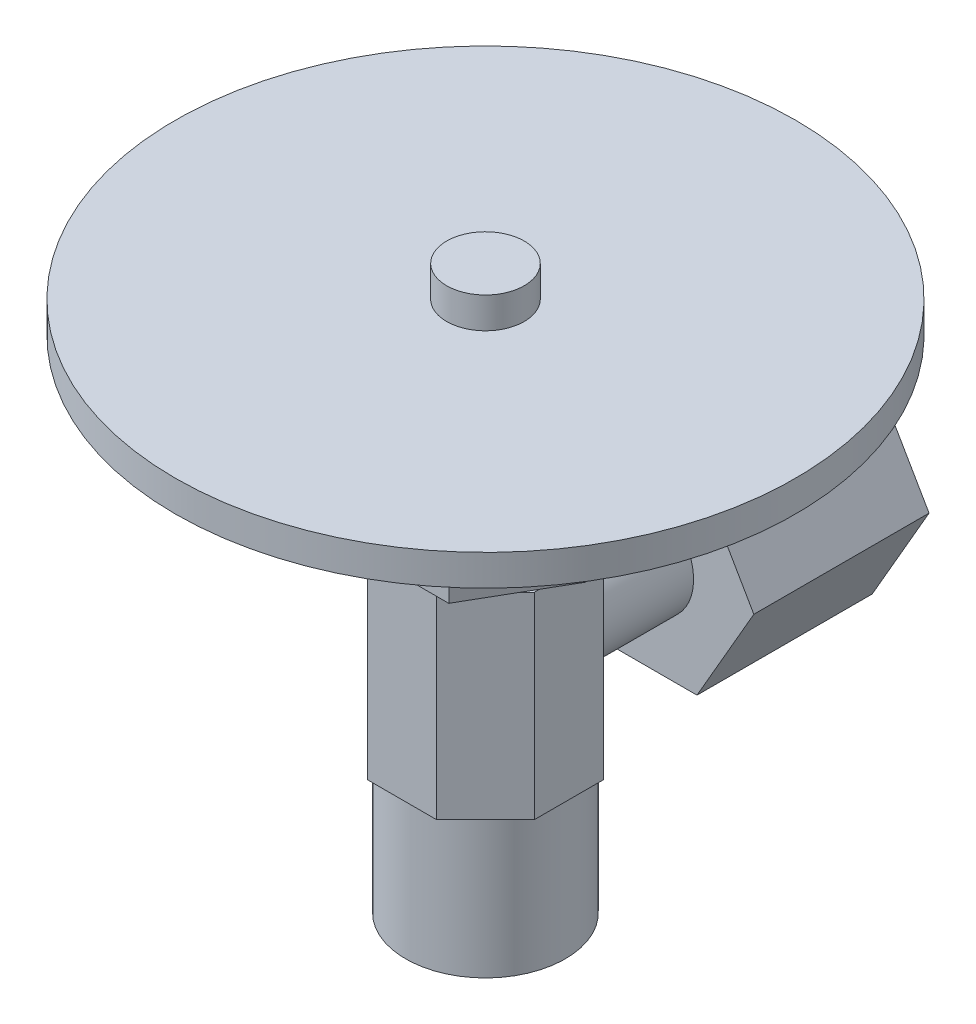
ISO-10303-21;
HEADER;
FILE_DESCRIPTION(('STEP AP214'),'2;1');
FILE_NAME('part.step','',(''),(''),'','','');
FILE_SCHEMA(('AUTOMOTIVE_DESIGN { 1 0 10303 214 1 1 1 1 }'));
ENDSEC;
DATA;
#1=APPLICATION_CONTEXT('core data for automotive mechanical design processes');
#2=APPLICATION_PROTOCOL_DEFINITION('international standard','automotive_design',2000,#1);
#3=PRODUCT_CONTEXT('',#1,'mechanical');
#4=PRODUCT('Part','Part','',(#3));
#5=PRODUCT_RELATED_PRODUCT_CATEGORY('part','',(#4));
#6=PRODUCT_DEFINITION_FORMATION('','',#4);
#7=PRODUCT_DEFINITION_CONTEXT('part definition',#1,'design');
#8=PRODUCT_DEFINITION('design','',#6,#7);
#9=PRODUCT_DEFINITION_SHAPE('','',#8);
#10=(LENGTH_UNIT() NAMED_UNIT(*) SI_UNIT(.MILLI.,.METRE.));
#11=(NAMED_UNIT(*) PLANE_ANGLE_UNIT() SI_UNIT($,.RADIAN.));
#12=(NAMED_UNIT(*) SI_UNIT($,.STERADIAN.) SOLID_ANGLE_UNIT());
#13=UNCERTAINTY_MEASURE_WITH_UNIT(LENGTH_MEASURE(1.E-05),#10,'distance_accuracy_value','');
#14=(GEOMETRIC_REPRESENTATION_CONTEXT(3) GLOBAL_UNCERTAINTY_ASSIGNED_CONTEXT((#13)) GLOBAL_UNIT_ASSIGNED_CONTEXT((#10,
#11,#12)) REPRESENTATION_CONTEXT('',''));
#15=CARTESIAN_POINT('',(0.,0.,0.));
#16=DIRECTION('',(0.,0.,1.));
#17=DIRECTION('',(1.,0.,0.));
#18=AXIS2_PLACEMENT_3D('',#15,#16,#17);
#19=CARTESIAN_POINT('',(0.,27.27,0.));
#20=DIRECTION('',(0.,-1.,0.));
#21=DIRECTION('',(0.,0.,-1.));
#22=AXIS2_PLACEMENT_3D('',#19,#20,#21);
#23=CYLINDRICAL_SURFACE('',#22,2.5);
#24=CARTESIAN_POINT('',(0.,21.27,0.));
#25=DIRECTION('',(0.,1.,0.));
#26=DIRECTION('',(0.,0.,1.));
#27=AXIS2_PLACEMENT_3D('',#24,#25,#26);
#28=CIRCLE('',#27,2.5);
#29=CARTESIAN_POINT('',(0.,21.27,2.5));
#30=VERTEX_POINT('',#29);
#31=EDGE_CURVE('E53',#30,#30,#28,.T.);
#32=ORIENTED_EDGE('',*,*,#31,.T.);
#33=EDGE_LOOP('',(#32));
#34=FACE_BOUND('',#33,.T.);
#35=CARTESIAN_POINT('',(0.,23.27,0.));
#36=DIRECTION('',(0.,1.,0.));
#37=DIRECTION('',(0.,0.,1.));
#38=AXIS2_PLACEMENT_3D('',#35,#36,#37);
#39=CIRCLE('',#38,2.5);
#40=CARTESIAN_POINT('',(0.,23.27,2.5));
#41=VERTEX_POINT('',#40);
#42=EDGE_CURVE('E11',#41,#41,#39,.T.);
#43=ORIENTED_EDGE('',*,*,#42,.F.);
#44=EDGE_LOOP('',(#43));
#45=FACE_BOUND('',#44,.T.);
#46=ADVANCED_FACE('F45',(#34,#45),#23,.T.);
#47=CARTESIAN_POINT('',(0.,12.7,0.));
#48=DIRECTION('',(0.,1.,0.));
#49=DIRECTION('',(0.,0.,1.));
#50=AXIS2_PLACEMENT_3D('',#47,#48,#49);
#51=PLANE('',#50);
#52=DIRECTION('',(0.5,0.,-0.866025403784439));
#53=VECTOR('',#52,1.);
#54=CARTESIAN_POINT('',(3.23316150746191,12.7,5.6));
#55=LINE('',#54,#53);
#56=CARTESIAN_POINT('',(4.91578188977825,12.7,2.68561600797714));
#57=VERTEX_POINT('',#56);
#58=CARTESIAN_POINT('',(5.375,12.7,1.8902269093173));
#59=VERTEX_POINT('',#58);
#60=EDGE_CURVE('E406',#57,#59,#55,.T.);
#61=ORIENTED_EDGE('',*,*,#60,.F.);
#62=DIRECTION('',(0.707106781186547,0.,-0.707106781186548));
#63=VECTOR('',#62,1.);
#64=CARTESIAN_POINT('',(2.22639789775539,12.7,5.375));
#65=LINE('',#64,#63);
#66=CARTESIAN_POINT('',(5.375,12.7,2.22639789775538));
#67=VERTEX_POINT('',#66);
#68=EDGE_CURVE('E319',#57,#67,#65,.T.);
#69=ORIENTED_EDGE('',*,*,#68,.T.);
#70=DIRECTION('',(0.,0.,-1.));
#71=VECTOR('',#70,1.);
#72=CARTESIAN_POINT('',(5.375,12.7,2.22639789775538));
#73=LINE('',#72,#71);
#74=EDGE_CURVE('E320',#67,#59,#73,.T.);
#75=ORIENTED_EDGE('',*,*,#74,.T.);
#76=EDGE_LOOP('',(#61,#69,#75));
#77=FACE_BOUND('',#76,.T.);
#78=ADVANCED_FACE('F491',(#77),#51,.T.);
#79=DIRECTION('',(0.5,0.,0.866025403784439));
#80=VECTOR('',#79,1.);
#81=CARTESIAN_POINT('',(-6.46632301492381,12.7,0.));
#82=LINE('',#81,#80);
#83=CARTESIAN_POINT('',(-5.375,12.7,1.89022690931729));
#84=VERTEX_POINT('',#83);
#85=CARTESIAN_POINT('',(-4.91578188977823,12.7,2.68561600797715));
#86=VERTEX_POINT('',#85);
#87=EDGE_CURVE('E67',#84,#86,#82,.T.);
#88=ORIENTED_EDGE('',*,*,#87,.F.);
#89=DIRECTION('',(0.,0.,1.));
#90=VECTOR('',#89,1.);
#91=CARTESIAN_POINT('',(-5.375,12.7,-2.22639789775539));
#92=LINE('',#91,#90);
#93=CARTESIAN_POINT('',(-5.375,12.7,2.22639789775539));
#94=VERTEX_POINT('',#93);
#95=EDGE_CURVE('E334',#84,#94,#92,.T.);
#96=ORIENTED_EDGE('',*,*,#95,.T.);
#97=DIRECTION('',(0.707106781186548,0.,0.707106781186548));
#98=VECTOR('',#97,1.);
#99=CARTESIAN_POINT('',(-5.375,12.7,2.22639789775539));
#100=LINE('',#99,#98);
#101=EDGE_CURVE('E339',#94,#86,#100,.T.);
#102=ORIENTED_EDGE('',*,*,#101,.T.);
#103=EDGE_LOOP('',(#88,#96,#102));
#104=FACE_BOUND('',#103,.T.);
#105=ADVANCED_FACE('F473',(#104),#51,.T.);
#106=DIRECTION('',(-0.5,0.,0.866025403784438));
#107=VECTOR('',#106,1.);
#108=CARTESIAN_POINT('',(-3.2331615074619,12.7,-5.6));
#109=LINE('',#108,#107);
#110=CARTESIAN_POINT('',(-4.91578188977824,12.7,-2.68561600797715));
#111=VERTEX_POINT('',#110);
#112=CARTESIAN_POINT('',(-5.375,12.7,-1.89022690931729));
#113=VERTEX_POINT('',#112);
#114=EDGE_CURVE('E427',#111,#113,#109,.T.);
#115=ORIENTED_EDGE('',*,*,#114,.F.);
#116=DIRECTION('',(-0.707106781186547,0.,0.707106781186548));
#117=VECTOR('',#116,1.);
#118=CARTESIAN_POINT('',(-2.22639789775539,12.7,-5.375));
#119=LINE('',#118,#117);
#120=CARTESIAN_POINT('',(-5.375,12.7,-2.22639789775539));
#121=VERTEX_POINT('',#120);
#122=EDGE_CURVE('E330',#111,#121,#119,.T.);
#123=ORIENTED_EDGE('',*,*,#122,.T.);
#124=EDGE_CURVE('E335',#121,#113,#92,.T.);
#125=ORIENTED_EDGE('',*,*,#124,.T.);
#126=EDGE_LOOP('',(#115,#123,#125));
#127=FACE_BOUND('',#126,.T.);
#128=ADVANCED_FACE('F460',(#127),#51,.T.);
#129=CARTESIAN_POINT('',(2.22639789775538,12.7,-5.375));
#130=DIRECTION('',(0.,0.,1.));
#131=DIRECTION('',(1.,0.,0.));
#132=AXIS2_PLACEMENT_3D('',#129,#130,#131);
#133=PLANE('',#132);
#134=DIRECTION('',(0.,-1.,0.));
#135=VECTOR('',#134,1.);
#136=CARTESIAN_POINT('',(2.22639789775538,12.7,-5.375));
#137=LINE('',#136,#135);
#138=CARTESIAN_POINT('',(2.22639789775538,12.7,-5.375));
#139=VERTEX_POINT('',#138);
#140=CARTESIAN_POINT('',(2.22639789775538,8.97891874633143,-5.375));
#141=VERTEX_POINT('',#140);
#142=EDGE_CURVE('E379',#139,#141,#137,.T.);
#143=ORIENTED_EDGE('',*,*,#142,.T.);
#144=CARTESIAN_POINT('',(0.,6.35,-5.375));
#145=DIRECTION('',(0.,0.,1.));
#146=DIRECTION('',(1.,0.,0.));
#147=AXIS2_PLACEMENT_3D('',#144,#145,#146);
#148=CIRCLE('',#147,3.44500527923288);
#149=CARTESIAN_POINT('',(-2.22639789775539,8.97891874633144,-5.375));
#150=VERTEX_POINT('',#149);
#151=EDGE_CURVE('E310',#141,#150,#148,.T.);
#152=ORIENTED_EDGE('',*,*,#151,.T.);
#153=DIRECTION('',(0.,-1.,0.));
#154=VECTOR('',#153,1.);
#155=CARTESIAN_POINT('',(-2.22639789775539,12.7,-5.375));
#156=LINE('',#155,#154);
#157=CARTESIAN_POINT('',(-2.22639789775539,12.7,-5.375));
#158=VERTEX_POINT('',#157);
#159=EDGE_CURVE('E375',#158,#150,#156,.T.);
#160=ORIENTED_EDGE('',*,*,#159,.F.);
#161=DIRECTION('',(-1.,0.,0.));
#162=VECTOR('',#161,1.);
#163=CARTESIAN_POINT('',(2.22639789775538,12.7,-5.375));
#164=LINE('',#163,#162);
#165=EDGE_CURVE('E327',#139,#158,#164,.T.);
#166=ORIENTED_EDGE('',*,*,#165,.F.);
#167=EDGE_LOOP('',(#143,#152,#160,#166));
#168=FACE_BOUND('',#167,.T.);
#169=ADVANCED_FACE('F686',(#168),#133,.F.);
#170=CARTESIAN_POINT('',(2.22639789775539,12.7,5.375));
#171=DIRECTION('',(-0.707106781186548,0.,-0.707106781186547));
#172=DIRECTION('',(-0.707106781186547,0.,0.707106781186548));
#173=AXIS2_PLACEMENT_3D('',#170,#171,#172);
#174=PLANE('',#173);
#175=DIRECTION('',(0.707106781186547,0.,-0.707106781186548));
#176=VECTOR('',#175,1.);
#177=CARTESIAN_POINT('',(2.22639789775539,0.,5.375));
#178=LINE('',#177,#176);
#179=CARTESIAN_POINT('',(2.22639789775539,0.,5.375));
#180=VERTEX_POINT('',#179);
#181=CARTESIAN_POINT('',(5.375,0.,2.22639789775538));
#182=VERTEX_POINT('',#181);
#183=EDGE_CURVE('E314',#180,#182,#178,.T.);
#184=ORIENTED_EDGE('',*,*,#183,.T.);
#185=DIRECTION('',(0.,-1.,0.));
#186=VECTOR('',#185,1.);
#187=CARTESIAN_POINT('',(5.375,12.7,2.22639789775538));
#188=LINE('',#187,#186);
#189=EDGE_CURVE('E385',#67,#182,#188,.T.);
#190=ORIENTED_EDGE('',*,*,#189,.F.);
#191=ORIENTED_EDGE('',*,*,#68,.F.);
#192=CARTESIAN_POINT('',(2.22639789775539,12.7,5.375));
#193=VERTEX_POINT('',#192);
#194=EDGE_CURVE('E315',#193,#57,#65,.T.);
#195=ORIENTED_EDGE('',*,*,#194,.F.);
#196=DIRECTION('',(0.,-1.,0.));
#197=VECTOR('',#196,1.);
#198=CARTESIAN_POINT('',(2.22639789775539,12.7,5.375));
#199=LINE('',#198,#197);
#200=EDGE_CURVE('E344',#193,#180,#199,.T.);
#201=ORIENTED_EDGE('',*,*,#200,.T.);
#202=EDGE_LOOP('',(#184,#190,#191,#195,#201));
#203=FACE_BOUND('',#202,.T.);
#204=ADVANCED_FACE('F47',(#203),#174,.F.);
#205=CARTESIAN_POINT('',(5.375,12.7,2.22639789775538));
#206=DIRECTION('',(-1.,0.,0.));
#207=DIRECTION('',(0.,0.,1.));
#208=AXIS2_PLACEMENT_3D('',#205,#206,#207);
#209=PLANE('',#208);
#210=DIRECTION('',(0.,0.,-1.));
#211=VECTOR('',#210,1.);
#212=CARTESIAN_POINT('',(5.375,0.,2.22639789775538));
#213=LINE('',#212,#211);
#214=CARTESIAN_POINT('',(5.375,0.,-2.22639789775539));
#215=VERTEX_POINT('',#214);
#216=EDGE_CURVE('E347',#182,#215,#213,.T.);
#217=ORIENTED_EDGE('',*,*,#216,.T.);
#218=DIRECTION('',(0.,-1.,0.));
#219=VECTOR('',#218,1.);
#220=CARTESIAN_POINT('',(5.375,12.7,-2.22639789775539));
#221=LINE('',#220,#219);
#222=CARTESIAN_POINT('',(5.375,12.7,-2.22639789775539));
#223=VERTEX_POINT('',#222);
#224=EDGE_CURVE('E382',#223,#215,#221,.T.);
#225=ORIENTED_EDGE('',*,*,#224,.F.);
#226=CARTESIAN_POINT('',(5.375,12.7,-1.8902269093173));
#227=VERTEX_POINT('',#226);
#228=EDGE_CURVE('E318',#227,#223,#73,.T.);
#229=ORIENTED_EDGE('',*,*,#228,.F.);
#230=EDGE_CURVE('E324',#59,#227,#73,.T.);
#231=ORIENTED_EDGE('',*,*,#230,.F.);
#232=ORIENTED_EDGE('',*,*,#74,.F.);
#233=ORIENTED_EDGE('',*,*,#189,.T.);
#234=EDGE_LOOP('',(#217,#225,#229,#231,#232,#233));
#235=FACE_BOUND('',#234,.T.);
#236=ADVANCED_FACE('F861',(#235),#209,.F.);
#237=CARTESIAN_POINT('',(5.375,12.7,-2.22639789775539));
#238=DIRECTION('',(-0.707106781186547,0.,0.707106781186548));
#239=DIRECTION('',(0.707106781186548,0.,0.707106781186547));
#240=AXIS2_PLACEMENT_3D('',#237,#238,#239);
#241=PLANE('',#240);
#242=CARTESIAN_POINT('',(2.22639789775538,3.72108125366856,-5.375));
#243=VERTEX_POINT('',#242);
#244=CARTESIAN_POINT('',(2.22639789775538,0.,-5.375));
#245=VERTEX_POINT('',#244);
#246=EDGE_CURVE('E378',#243,#245,#137,.T.);
#247=ORIENTED_EDGE('',*,*,#246,.F.);
#248=CARTESIAN_POINT('',(0.,6.35,-7.60139789775539));
#249=DIRECTION('',(-0.707106781186547,0.,0.707106781186548));
#250=DIRECTION('',(-0.707106781186548,0.,-0.707106781186547));
#251=AXIS2_PLACEMENT_3D('',#248,#249,#250);
#252=ELLIPSE('',#251,4.87197318833806,3.44500527923288);
#253=EDGE_CURVE('E311',#243,#141,#252,.T.);
#254=ORIENTED_EDGE('',*,*,#253,.T.);
#255=ORIENTED_EDGE('',*,*,#142,.F.);
#256=DIRECTION('',(-0.707106781186548,0.,-0.707106781186547));
#257=VECTOR('',#256,1.);
#258=CARTESIAN_POINT('',(5.375,12.7,-2.22639789775539));
#259=LINE('',#258,#257);
#260=CARTESIAN_POINT('',(4.91578188977824,12.7,-2.68561600797715));
#261=VERTEX_POINT('',#260);
#262=EDGE_CURVE('E323',#261,#139,#259,.T.);
#263=ORIENTED_EDGE('',*,*,#262,.F.);
#264=EDGE_CURVE('E325',#223,#261,#259,.T.);
#265=ORIENTED_EDGE('',*,*,#264,.F.);
#266=ORIENTED_EDGE('',*,*,#224,.T.);
#267=DIRECTION('',(-0.707106781186548,0.,-0.707106781186547));
#268=VECTOR('',#267,1.);
#269=CARTESIAN_POINT('',(5.375,0.,-2.22639789775539));
#270=LINE('',#269,#268);
#271=EDGE_CURVE('E349',#215,#245,#270,.T.);
#272=ORIENTED_EDGE('',*,*,#271,.T.);
#273=EDGE_LOOP('',(#247,#254,#255,#263,#265,#266,#272));
#274=FACE_BOUND('',#273,.T.);
#275=ADVANCED_FACE('F853',(#274),#241,.F.);
#276=CARTESIAN_POINT('',(-2.22639789775539,3.72108125366856,-5.375));
#277=VERTEX_POINT('',#276);
#278=CARTESIAN_POINT('',(-2.22639789775539,0.,-5.375));
#279=VERTEX_POINT('',#278);
#280=EDGE_CURVE('E374',#277,#279,#156,.T.);
#281=ORIENTED_EDGE('',*,*,#280,.F.);
#282=EDGE_CURVE('E307',#277,#243,#148,.T.);
#283=ORIENTED_EDGE('',*,*,#282,.T.);
#284=ORIENTED_EDGE('',*,*,#246,.T.);
#285=DIRECTION('',(-1.,0.,0.));
#286=VECTOR('',#285,1.);
#287=CARTESIAN_POINT('',(2.22639789775538,0.,-5.375));
#288=LINE('',#287,#286);
#289=EDGE_CURVE('E352',#245,#279,#288,.T.);
#290=ORIENTED_EDGE('',*,*,#289,.T.);
#291=EDGE_LOOP('',(#281,#283,#284,#290));
#292=FACE_BOUND('',#291,.T.);
#293=ADVANCED_FACE('F807',(#292),#133,.F.);
#294=CARTESIAN_POINT('',(-2.22639789775539,12.7,-5.375));
#295=DIRECTION('',(0.707106781186548,0.,0.707106781186547));
#296=DIRECTION('',(0.707106781186547,0.,-0.707106781186548));
#297=AXIS2_PLACEMENT_3D('',#294,#295,#296);
#298=PLANE('',#297);
#299=ORIENTED_EDGE('',*,*,#159,.T.);
#300=CARTESIAN_POINT('',(0.,6.35,-7.60139789775539));
#301=DIRECTION('',(0.707106781186548,0.,0.707106781186547));
#302=DIRECTION('',(0.707106781186547,0.,-0.707106781186548));
#303=AXIS2_PLACEMENT_3D('',#300,#301,#302);
#304=ELLIPSE('',#303,4.87197318833806,3.44500527923288);
#305=EDGE_CURVE('E260',#150,#277,#304,.T.);
#306=ORIENTED_EDGE('',*,*,#305,.T.);
#307=ORIENTED_EDGE('',*,*,#280,.T.);
#308=DIRECTION('',(-0.707106781186547,0.,0.707106781186548));
#309=VECTOR('',#308,1.);
#310=CARTESIAN_POINT('',(-2.22639789775539,0.,-5.375));
#311=LINE('',#310,#309);
#312=CARTESIAN_POINT('',(-5.375,0.,-2.22639789775539));
#313=VERTEX_POINT('',#312);
#314=EDGE_CURVE('E355',#279,#313,#311,.T.);
#315=ORIENTED_EDGE('',*,*,#314,.T.);
#316=DIRECTION('',(0.,-1.,0.));
#317=VECTOR('',#316,1.);
#318=CARTESIAN_POINT('',(-5.375,12.7,-2.22639789775539));
#319=LINE('',#318,#317);
#320=EDGE_CURVE('E371',#121,#313,#319,.T.);
#321=ORIENTED_EDGE('',*,*,#320,.F.);
#322=ORIENTED_EDGE('',*,*,#122,.F.);
#323=EDGE_CURVE('E331',#158,#111,#119,.T.);
#324=ORIENTED_EDGE('',*,*,#323,.F.);
#325=EDGE_LOOP('',(#299,#306,#307,#315,#321,#322,#324));
#326=FACE_BOUND('',#325,.T.);
#327=ADVANCED_FACE('F456',(#326),#298,.F.);
#328=CARTESIAN_POINT('',(-5.375,12.7,-2.22639789775539));
#329=DIRECTION('',(1.,0.,0.));
#330=DIRECTION('',(0.,0.,-1.));
#331=AXIS2_PLACEMENT_3D('',#328,#329,#330);
#332=PLANE('',#331);
#333=DIRECTION('',(0.,0.,1.));
#334=VECTOR('',#333,1.);
#335=CARTESIAN_POINT('',(-5.375,0.,-2.22639789775539));
#336=LINE('',#335,#334);
#337=CARTESIAN_POINT('',(-5.375,0.,2.22639789775539));
#338=VERTEX_POINT('',#337);
#339=EDGE_CURVE('E357',#313,#338,#336,.T.);
#340=ORIENTED_EDGE('',*,*,#339,.T.);
#341=DIRECTION('',(0.,-1.,0.));
#342=VECTOR('',#341,1.);
#343=CARTESIAN_POINT('',(-5.375,12.7,2.22639789775539));
#344=LINE('',#343,#342);
#345=EDGE_CURVE('E368',#94,#338,#344,.T.);
#346=ORIENTED_EDGE('',*,*,#345,.F.);
#347=ORIENTED_EDGE('',*,*,#95,.F.);
#348=EDGE_CURVE('E338',#113,#84,#92,.T.);
#349=ORIENTED_EDGE('',*,*,#348,.F.);
#350=ORIENTED_EDGE('',*,*,#124,.F.);
#351=ORIENTED_EDGE('',*,*,#320,.T.);
#352=EDGE_LOOP('',(#340,#346,#347,#349,#350,#351));
#353=FACE_BOUND('',#352,.T.);
#354=ADVANCED_FACE('F475',(#353),#332,.F.);
#355=CARTESIAN_POINT('',(-5.375,12.7,2.22639789775539));
#356=DIRECTION('',(0.707106781186548,0.,-0.707106781186548));
#357=DIRECTION('',(-0.707106781186548,0.,-0.707106781186548));
#358=AXIS2_PLACEMENT_3D('',#355,#356,#357);
#359=PLANE('',#358);
#360=DIRECTION('',(0.707106781186548,0.,0.707106781186548));
#361=VECTOR('',#360,1.);
#362=CARTESIAN_POINT('',(-5.375,0.,2.22639789775539));
#363=LINE('',#362,#361);
#364=CARTESIAN_POINT('',(-2.22639789775539,0.,5.375));
#365=VERTEX_POINT('',#364);
#366=EDGE_CURVE('E359',#338,#365,#363,.T.);
#367=ORIENTED_EDGE('',*,*,#366,.T.);
#368=DIRECTION('',(0.,-1.,0.));
#369=VECTOR('',#368,1.);
#370=CARTESIAN_POINT('',(-2.22639789775539,12.7,5.375));
#371=LINE('',#370,#369);
#372=CARTESIAN_POINT('',(-2.22639789775539,12.7,5.375));
#373=VERTEX_POINT('',#372);
#374=EDGE_CURVE('E365',#373,#365,#371,.T.);
#375=ORIENTED_EDGE('',*,*,#374,.F.);
#376=EDGE_CURVE('E60',#86,#373,#100,.T.);
#377=ORIENTED_EDGE('',*,*,#376,.F.);
#378=ORIENTED_EDGE('',*,*,#101,.F.);
#379=ORIENTED_EDGE('',*,*,#345,.T.);
#380=EDGE_LOOP('',(#367,#375,#377,#378,#379));
#381=FACE_BOUND('',#380,.T.);
#382=ADVANCED_FACE('F478',(#381),#359,.F.);
#383=CARTESIAN_POINT('',(-2.22639789775539,12.7,5.375));
#384=DIRECTION('',(0.,0.,-1.));
#385=DIRECTION('',(-1.,0.,0.));
#386=AXIS2_PLACEMENT_3D('',#383,#384,#385);
#387=PLANE('',#386);
#388=DIRECTION('',(1.,0.,0.));
#389=VECTOR('',#388,1.);
#390=CARTESIAN_POINT('',(-2.22639789775539,0.,5.375));
#391=LINE('',#390,#389);
#392=EDGE_CURVE('E361',#365,#180,#391,.T.);
#393=ORIENTED_EDGE('',*,*,#392,.T.);
#394=ORIENTED_EDGE('',*,*,#200,.F.);
#395=DIRECTION('',(1.,0.,0.));
#396=VECTOR('',#395,1.);
#397=CARTESIAN_POINT('',(-2.22639789775539,12.7,5.375));
#398=LINE('',#397,#396);
#399=EDGE_CURVE('E341',#373,#193,#398,.T.);
#400=ORIENTED_EDGE('',*,*,#399,.F.);
#401=ORIENTED_EDGE('',*,*,#374,.T.);
#402=EDGE_LOOP('',(#393,#394,#400,#401));
#403=FACE_BOUND('',#402,.T.);
#404=ADVANCED_FACE('F480',(#403),#387,.F.);
#405=DIRECTION('',(-0.5,0.,-0.866025403784438));
#406=VECTOR('',#405,1.);
#407=CARTESIAN_POINT('',(6.46632301492382,12.7,0.));
#408=LINE('',#407,#406);
#409=EDGE_CURVE('E259',#227,#261,#408,.T.);
#410=ORIENTED_EDGE('',*,*,#409,.F.);
#411=ORIENTED_EDGE('',*,*,#228,.T.);
#412=ORIENTED_EDGE('',*,*,#264,.T.);
#413=EDGE_LOOP('',(#410,#411,#412));
#414=FACE_BOUND('',#413,.T.);
#415=ADVANCED_FACE('F486',(#414),#51,.T.);
#416=CARTESIAN_POINT('',(0.,0.,0.));
#417=DIRECTION('',(0.,1.,0.));
#418=DIRECTION('',(0.,0.,1.));
#419=AXIS2_PLACEMENT_3D('',#416,#417,#418);
#420=PLANE('',#419);
#421=CARTESIAN_POINT('',(0.,0.,0.));
#422=DIRECTION('',(0.,-1.,0.));
#423=DIRECTION('',(0.,0.,-1.));
#424=AXIS2_PLACEMENT_3D('',#421,#422,#423);
#425=CIRCLE('',#424,5.15);
#426=CARTESIAN_POINT('',(0.,0.,-5.15));
#427=VERTEX_POINT('',#426);
#428=EDGE_CURVE('E256',#427,#427,#425,.T.);
#429=ORIENTED_EDGE('',*,*,#428,.F.);
#430=EDGE_LOOP('',(#429));
#431=FACE_BOUND('',#430,.T.);
#432=ORIENTED_EDGE('',*,*,#183,.F.);
#433=ORIENTED_EDGE('',*,*,#392,.F.);
#434=ORIENTED_EDGE('',*,*,#366,.F.);
#435=ORIENTED_EDGE('',*,*,#339,.F.);
#436=ORIENTED_EDGE('',*,*,#314,.F.);
#437=ORIENTED_EDGE('',*,*,#289,.F.);
#438=ORIENTED_EDGE('',*,*,#271,.F.);
#439=ORIENTED_EDGE('',*,*,#216,.F.);
#440=EDGE_LOOP('',(#432,#433,#434,#435,#436,#437,#438,#439));
#441=FACE_BOUND('',#440,.T.);
#442=ADVANCED_FACE('F794',(#431,#441),#420,.F.);
#443=CARTESIAN_POINT('',(0.,6.35,-3.375));
#444=DIRECTION('',(0.,0.,-1.));
#445=DIRECTION('',(-1.,0.,0.));
#446=AXIS2_PLACEMENT_3D('',#443,#444,#445);
#447=CYLINDRICAL_SURFACE('',#446,3.44500527923288);
#448=CARTESIAN_POINT('',(0.,6.35,-9.975));
#449=DIRECTION('',(0.,0.,-1.));
#450=DIRECTION('',(-1.,0.,0.));
#451=AXIS2_PLACEMENT_3D('',#448,#449,#450);
#452=CIRCLE('',#451,3.44500527923288);
#453=CARTESIAN_POINT('',(-3.44500527923289,6.35,-9.975));
#454=VERTEX_POINT('',#453);
#455=EDGE_CURVE('E304',#454,#454,#452,.T.);
#456=ORIENTED_EDGE('',*,*,#455,.F.);
#457=EDGE_LOOP('',(#456));
#458=FACE_BOUND('',#457,.T.);
#459=ORIENTED_EDGE('',*,*,#253,.F.);
#460=ORIENTED_EDGE('',*,*,#282,.F.);
#461=ORIENTED_EDGE('',*,*,#305,.F.);
#462=ORIENTED_EDGE('',*,*,#151,.F.);
#463=EDGE_LOOP('',(#459,#460,#461,#462));
#464=FACE_BOUND('',#463,.T.);
#465=ADVANCED_FACE('F784',(#458,#464),#447,.T.);
#466=CARTESIAN_POINT('',(-3.66617420935412,0.,-21.275));
#467=DIRECTION('',(0.866025403784439,0.5,0.));
#468=DIRECTION('',(-0.5,0.866025403784439,0.));
#469=AXIS2_PLACEMENT_3D('',#466,#467,#468);
#470=PLANE('',#469);
#471=DIRECTION('',(-0.5,0.866025403784439,0.));
#472=VECTOR('',#471,1.);
#473=CARTESIAN_POINT('',(-3.66617420935412,0.,-9.975));
#474=LINE('',#473,#472);
#475=CARTESIAN_POINT('',(-3.66617420935412,0.,-9.975));
#476=VERTEX_POINT('',#475);
#477=CARTESIAN_POINT('',(-7.33234841870825,6.35,-9.975));
#478=VERTEX_POINT('',#477);
#479=EDGE_CURVE('E250',#476,#478,#474,.T.);
#480=ORIENTED_EDGE('',*,*,#479,.T.);
#481=DIRECTION('',(0.,0.,1.));
#482=VECTOR('',#481,1.);
#483=CARTESIAN_POINT('',(-7.33234841870825,6.35,-21.275));
#484=LINE('',#483,#482);
#485=CARTESIAN_POINT('',(-7.33234841870825,6.35,-21.275));
#486=VERTEX_POINT('',#485);
#487=EDGE_CURVE('E301',#486,#478,#484,.T.);
#488=ORIENTED_EDGE('',*,*,#487,.F.);
#489=DIRECTION('',(-0.5,0.866025403784439,0.));
#490=VECTOR('',#489,1.);
#491=CARTESIAN_POINT('',(-3.66617420935412,0.,-21.275));
#492=LINE('',#491,#490);
#493=CARTESIAN_POINT('',(-3.66617420935412,0.,-21.275));
#494=VERTEX_POINT('',#493);
#495=EDGE_CURVE('E261',#494,#486,#492,.T.);
#496=ORIENTED_EDGE('',*,*,#495,.F.);
#497=DIRECTION('',(0.,0.,1.));
#498=VECTOR('',#497,1.);
#499=CARTESIAN_POINT('',(-3.66617420935412,0.,-21.275));
#500=LINE('',#499,#498);
#501=EDGE_CURVE('E275',#494,#476,#500,.T.);
#502=ORIENTED_EDGE('',*,*,#501,.T.);
#503=EDGE_LOOP('',(#480,#488,#496,#502));
#504=FACE_BOUND('',#503,.T.);
#505=ADVANCED_FACE('F774',(#504),#470,.F.);
#506=CARTESIAN_POINT('',(-7.33234841870825,6.35,-21.275));
#507=DIRECTION('',(0.866025403784438,-0.5,0.));
#508=DIRECTION('',(0.5,0.866025403784439,0.));
#509=AXIS2_PLACEMENT_3D('',#506,#507,#508);
#510=PLANE('',#509);
#511=DIRECTION('',(0.5,0.866025403784438,0.));
#512=VECTOR('',#511,1.);
#513=CARTESIAN_POINT('',(-7.33234841870825,6.35,-9.975));
#514=LINE('',#513,#512);
#515=CARTESIAN_POINT('',(-3.66617420935412,12.7,-9.975));
#516=VERTEX_POINT('',#515);
#517=EDGE_CURVE('E278',#478,#516,#514,.T.);
#518=ORIENTED_EDGE('',*,*,#517,.T.);
#519=DIRECTION('',(0.,0.,1.));
#520=VECTOR('',#519,1.);
#521=CARTESIAN_POINT('',(-3.66617420935412,12.7,-21.275));
#522=LINE('',#521,#520);
#523=CARTESIAN_POINT('',(-3.66617420935412,12.7,-21.275));
#524=VERTEX_POINT('',#523);
#525=EDGE_CURVE('E298',#524,#516,#522,.T.);
#526=ORIENTED_EDGE('',*,*,#525,.F.);
#527=DIRECTION('',(0.5,0.866025403784438,0.));
#528=VECTOR('',#527,1.);
#529=CARTESIAN_POINT('',(-7.33234841870825,6.35,-21.275));
#530=LINE('',#529,#528);
#531=EDGE_CURVE('E264',#486,#524,#530,.T.);
#532=ORIENTED_EDGE('',*,*,#531,.F.);
#533=ORIENTED_EDGE('',*,*,#487,.T.);
#534=EDGE_LOOP('',(#518,#526,#532,#533));
#535=FACE_BOUND('',#534,.T.);
#536=ADVANCED_FACE('F764',(#535),#510,.F.);
#537=CARTESIAN_POINT('',(-3.66617420935412,12.7,-21.275));
#538=DIRECTION('',(0.,-1.,0.));
#539=DIRECTION('',(1.,0.,0.));
#540=AXIS2_PLACEMENT_3D('',#537,#538,#539);
#541=PLANE('',#540);
#542=DIRECTION('',(1.,0.,0.));
#543=VECTOR('',#542,1.);
#544=CARTESIAN_POINT('',(-3.66617420935412,12.7,-9.975));
#545=LINE('',#544,#543);
#546=CARTESIAN_POINT('',(3.66617420935412,12.7,-9.975));
#547=VERTEX_POINT('',#546);
#548=EDGE_CURVE('E280',#516,#547,#545,.T.);
#549=ORIENTED_EDGE('',*,*,#548,.T.);
#550=DIRECTION('',(0.,0.,1.));
#551=VECTOR('',#550,1.);
#552=CARTESIAN_POINT('',(3.66617420935412,12.7,-21.275));
#553=LINE('',#552,#551);
#554=CARTESIAN_POINT('',(3.66617420935412,12.7,-21.275));
#555=VERTEX_POINT('',#554);
#556=EDGE_CURVE('E295',#555,#547,#553,.T.);
#557=ORIENTED_EDGE('',*,*,#556,.F.);
#558=DIRECTION('',(1.,0.,0.));
#559=VECTOR('',#558,1.);
#560=CARTESIAN_POINT('',(-3.66617420935412,12.7,-21.275));
#561=LINE('',#560,#559);
#562=EDGE_CURVE('E267',#524,#555,#561,.T.);
#563=ORIENTED_EDGE('',*,*,#562,.F.);
#564=ORIENTED_EDGE('',*,*,#525,.T.);
#565=EDGE_LOOP('',(#549,#557,#563,#564));
#566=FACE_BOUND('',#565,.T.);
#567=ADVANCED_FACE('F754',(#566),#541,.F.);
#568=CARTESIAN_POINT('',(3.66617420935412,12.7,-21.275));
#569=DIRECTION('',(-0.866025403784438,-0.5,0.));
#570=DIRECTION('',(0.5,-0.866025403784439,0.));
#571=AXIS2_PLACEMENT_3D('',#568,#569,#570);
#572=PLANE('',#571);
#573=DIRECTION('',(0.5,-0.866025403784438,0.));
#574=VECTOR('',#573,1.);
#575=CARTESIAN_POINT('',(3.66617420935412,12.7,-9.975));
#576=LINE('',#575,#574);
#577=CARTESIAN_POINT('',(7.33234841870824,6.35,-9.975));
#578=VERTEX_POINT('',#577);
#579=EDGE_CURVE('E282',#547,#578,#576,.T.);
#580=ORIENTED_EDGE('',*,*,#579,.T.);
#581=DIRECTION('',(0.,0.,1.));
#582=VECTOR('',#581,1.);
#583=CARTESIAN_POINT('',(7.33234841870824,6.35,-21.275));
#584=LINE('',#583,#582);
#585=CARTESIAN_POINT('',(7.33234841870824,6.35,-21.275));
#586=VERTEX_POINT('',#585);
#587=EDGE_CURVE('E292',#586,#578,#584,.T.);
#588=ORIENTED_EDGE('',*,*,#587,.F.);
#589=DIRECTION('',(0.5,-0.866025403784438,0.));
#590=VECTOR('',#589,1.);
#591=CARTESIAN_POINT('',(3.66617420935412,12.7,-21.275));
#592=LINE('',#591,#590);
#593=EDGE_CURVE('E269',#555,#586,#592,.T.);
#594=ORIENTED_EDGE('',*,*,#593,.F.);
#595=ORIENTED_EDGE('',*,*,#556,.T.);
#596=EDGE_LOOP('',(#580,#588,#594,#595));
#597=FACE_BOUND('',#596,.T.);
#598=ADVANCED_FACE('F744',(#597),#572,.F.);
#599=CARTESIAN_POINT('',(7.33234841870824,6.35,-21.275));
#600=DIRECTION('',(-0.866025403784439,0.5,0.));
#601=DIRECTION('',(-0.5,-0.866025403784439,0.));
#602=AXIS2_PLACEMENT_3D('',#599,#600,#601);
#603=PLANE('',#602);
#604=DIRECTION('',(-0.5,-0.866025403784439,0.));
#605=VECTOR('',#604,1.);
#606=CARTESIAN_POINT('',(7.33234841870824,6.35,-9.975));
#607=LINE('',#606,#605);
#608=CARTESIAN_POINT('',(3.66617420935412,0.,-9.975));
#609=VERTEX_POINT('',#608);
#610=EDGE_CURVE('E284',#578,#609,#607,.T.);
#611=ORIENTED_EDGE('',*,*,#610,.T.);
#612=DIRECTION('',(0.,0.,1.));
#613=VECTOR('',#612,1.);
#614=CARTESIAN_POINT('',(3.66617420935412,0.,-21.275));
#615=LINE('',#614,#613);
#616=CARTESIAN_POINT('',(3.66617420935412,0.,-21.275));
#617=VERTEX_POINT('',#616);
#618=EDGE_CURVE('E289',#617,#609,#615,.T.);
#619=ORIENTED_EDGE('',*,*,#618,.F.);
#620=DIRECTION('',(-0.5,-0.866025403784439,0.));
#621=VECTOR('',#620,1.);
#622=CARTESIAN_POINT('',(7.33234841870824,6.35,-21.275));
#623=LINE('',#622,#621);
#624=EDGE_CURVE('E271',#586,#617,#623,.T.);
#625=ORIENTED_EDGE('',*,*,#624,.F.);
#626=ORIENTED_EDGE('',*,*,#587,.T.);
#627=EDGE_LOOP('',(#611,#619,#625,#626));
#628=FACE_BOUND('',#627,.T.);
#629=ADVANCED_FACE('F734',(#628),#603,.F.);
#630=CARTESIAN_POINT('',(3.66617420935412,0.,-21.275));
#631=DIRECTION('',(0.,1.,0.));
#632=DIRECTION('',(-1.,0.,0.));
#633=AXIS2_PLACEMENT_3D('',#630,#631,#632);
#634=PLANE('',#633);
#635=DIRECTION('',(-1.,0.,0.));
#636=VECTOR('',#635,1.);
#637=CARTESIAN_POINT('',(3.66617420935412,0.,-9.975));
#638=LINE('',#637,#636);
#639=EDGE_CURVE('E265',#609,#476,#638,.T.);
#640=ORIENTED_EDGE('',*,*,#639,.T.);
#641=ORIENTED_EDGE('',*,*,#501,.F.);
#642=DIRECTION('',(-1.,0.,0.));
#643=VECTOR('',#642,1.);
#644=CARTESIAN_POINT('',(3.66617420935412,0.,-21.275));
#645=LINE('',#644,#643);
#646=EDGE_CURVE('E273',#617,#494,#645,.T.);
#647=ORIENTED_EDGE('',*,*,#646,.F.);
#648=ORIENTED_EDGE('',*,*,#618,.T.);
#649=EDGE_LOOP('',(#640,#641,#647,#648));
#650=FACE_BOUND('',#649,.T.);
#651=ADVANCED_FACE('F724',(#650),#634,.F.);
#652=CARTESIAN_POINT('',(0.,0.,-21.275));
#653=DIRECTION('',(0.,0.,-1.));
#654=DIRECTION('',(-1.,0.,0.));
#655=AXIS2_PLACEMENT_3D('',#652,#653,#654);
#656=PLANE('',#655);
#657=ORIENTED_EDGE('',*,*,#495,.T.);
#658=ORIENTED_EDGE('',*,*,#531,.T.);
#659=ORIENTED_EDGE('',*,*,#562,.T.);
#660=ORIENTED_EDGE('',*,*,#593,.T.);
#661=ORIENTED_EDGE('',*,*,#624,.T.);
#662=ORIENTED_EDGE('',*,*,#646,.T.);
#663=EDGE_LOOP('',(#657,#658,#659,#660,#661,#662));
#664=FACE_BOUND('',#663,.T.);
#665=ADVANCED_FACE('F714',(#664),#656,.T.);
#666=CARTESIAN_POINT('',(0.,0.,-9.975));
#667=DIRECTION('',(0.,0.,-1.));
#668=DIRECTION('',(-1.,0.,0.));
#669=AXIS2_PLACEMENT_3D('',#666,#667,#668);
#670=PLANE('',#669);
#671=ORIENTED_EDGE('',*,*,#455,.T.);
#672=EDGE_LOOP('',(#671));
#673=FACE_BOUND('',#672,.T.);
#674=ORIENTED_EDGE('',*,*,#479,.F.);
#675=ORIENTED_EDGE('',*,*,#639,.F.);
#676=ORIENTED_EDGE('',*,*,#610,.F.);
#677=ORIENTED_EDGE('',*,*,#579,.F.);
#678=ORIENTED_EDGE('',*,*,#548,.F.);
#679=ORIENTED_EDGE('',*,*,#517,.F.);
#680=EDGE_LOOP('',(#674,#675,#676,#677,#678,#679));
#681=FACE_BOUND('',#680,.T.);
#682=ADVANCED_FACE('F703',(#673,#681),#670,.F.);
#683=CARTESIAN_POINT('',(0.,-9.,0.));
#684=DIRECTION('',(0.,1.,0.));
#685=DIRECTION('',(0.,0.,1.));
#686=AXIS2_PLACEMENT_3D('',#683,#684,#685);
#687=CYLINDRICAL_SURFACE('',#686,5.15);
#688=CARTESIAN_POINT('',(0.,-9.,0.));
#689=DIRECTION('',(0.,-1.,0.));
#690=DIRECTION('',(0.,0.,-1.));
#691=AXIS2_PLACEMENT_3D('',#688,#689,#690);
#692=CIRCLE('',#691,5.15);
#693=CARTESIAN_POINT('',(0.,-9.,-5.15));
#694=VERTEX_POINT('',#693);
#695=EDGE_CURVE('E247',#694,#694,#692,.T.);
#696=ORIENTED_EDGE('',*,*,#695,.F.);
#697=EDGE_LOOP('',(#696));
#698=FACE_BOUND('',#697,.T.);
#699=ORIENTED_EDGE('',*,*,#428,.T.);
#700=EDGE_LOOP('',(#699));
#701=FACE_BOUND('',#700,.T.);
#702=ADVANCED_FACE('F693',(#698,#701),#687,.T.);
#703=CARTESIAN_POINT('',(0.,-9.,0.));
#704=DIRECTION('',(0.,-1.,0.));
#705=DIRECTION('',(0.,0.,-1.));
#706=AXIS2_PLACEMENT_3D('',#703,#704,#705);
#707=PLANE('',#706);
#708=ORIENTED_EDGE('',*,*,#695,.T.);
#709=EDGE_LOOP('',(#708));
#710=FACE_BOUND('',#709,.T.);
#711=ADVANCED_FACE('F664',(#710),#707,.T.);
#712=CARTESIAN_POINT('',(0.,12.7,0.));
#713=DIRECTION('',(0.,1.,0.));
#714=DIRECTION('',(0.,0.,1.));
#715=AXIS2_PLACEMENT_3D('',#712,#713,#714);
#716=PLANE('',#715);
#717=CARTESIAN_POINT('',(6.46632301492382,12.7,0.));
#718=VERTEX_POINT('',#717);
#719=EDGE_CURVE('E245',#59,#718,#55,.T.);
#720=ORIENTED_EDGE('',*,*,#719,.F.);
#721=ORIENTED_EDGE('',*,*,#230,.T.);
#722=EDGE_CURVE('E418',#718,#227,#408,.T.);
#723=ORIENTED_EDGE('',*,*,#722,.F.);
#724=EDGE_LOOP('',(#720,#721,#723));
#725=FACE_BOUND('',#724,.T.);
#726=ADVANCED_FACE('F642',(#725),#716,.F.);
#727=CARTESIAN_POINT('',(3.23316150746191,12.7,-5.6));
#728=VERTEX_POINT('',#727);
#729=EDGE_CURVE('E417',#261,#728,#408,.T.);
#730=ORIENTED_EDGE('',*,*,#729,.F.);
#731=ORIENTED_EDGE('',*,*,#262,.T.);
#732=ORIENTED_EDGE('',*,*,#165,.T.);
#733=ORIENTED_EDGE('',*,*,#323,.T.);
#734=CARTESIAN_POINT('',(-3.2331615074619,12.7,-5.6));
#735=VERTEX_POINT('',#734);
#736=EDGE_CURVE('E423',#735,#111,#109,.T.);
#737=ORIENTED_EDGE('',*,*,#736,.F.);
#738=DIRECTION('',(-1.,0.,0.));
#739=VECTOR('',#738,1.);
#740=CARTESIAN_POINT('',(3.23316150746191,12.7,-5.6));
#741=LINE('',#740,#739);
#742=EDGE_CURVE('E420',#728,#735,#741,.T.);
#743=ORIENTED_EDGE('',*,*,#742,.F.);
#744=EDGE_LOOP('',(#730,#731,#732,#733,#737,#743));
#745=FACE_BOUND('',#744,.T.);
#746=ADVANCED_FACE('F450',(#745),#716,.F.);
#747=CARTESIAN_POINT('',(-6.46632301492381,12.7,0.));
#748=VERTEX_POINT('',#747);
#749=EDGE_CURVE('E422',#113,#748,#109,.T.);
#750=ORIENTED_EDGE('',*,*,#749,.F.);
#751=ORIENTED_EDGE('',*,*,#348,.T.);
#752=EDGE_CURVE('E428',#748,#84,#82,.T.);
#753=ORIENTED_EDGE('',*,*,#752,.F.);
#754=EDGE_LOOP('',(#750,#751,#753));
#755=FACE_BOUND('',#754,.T.);
#756=ADVANCED_FACE('F470',(#755),#716,.F.);
#757=ORIENTED_EDGE('',*,*,#399,.T.);
#758=ORIENTED_EDGE('',*,*,#194,.T.);
#759=CARTESIAN_POINT('',(3.23316150746191,12.7,5.6));
#760=VERTEX_POINT('',#759);
#761=EDGE_CURVE('E415',#760,#57,#55,.T.);
#762=ORIENTED_EDGE('',*,*,#761,.F.);
#763=DIRECTION('',(1.,0.,0.));
#764=VECTOR('',#763,1.);
#765=CARTESIAN_POINT('',(-3.23316150746191,12.7,5.6));
#766=LINE('',#765,#764);
#767=CARTESIAN_POINT('',(-3.23316150746191,12.7,5.6));
#768=VERTEX_POINT('',#767);
#769=EDGE_CURVE('E239',#768,#760,#766,.T.);
#770=ORIENTED_EDGE('',*,*,#769,.F.);
#771=EDGE_CURVE('E426',#86,#768,#82,.T.);
#772=ORIENTED_EDGE('',*,*,#771,.F.);
#773=ORIENTED_EDGE('',*,*,#376,.T.);
#774=EDGE_LOOP('',(#757,#758,#762,#770,#772,#773));
#775=FACE_BOUND('',#774,.T.);
#776=ADVANCED_FACE('F631',(#775),#716,.F.);
#777=CARTESIAN_POINT('',(3.23316150746191,21.27,5.6));
#778=DIRECTION('',(-0.866025403784439,0.,-0.5));
#779=DIRECTION('',(-0.5,0.,0.866025403784439));
#780=AXIS2_PLACEMENT_3D('',#777,#778,#779);
#781=PLANE('',#780);
#782=ORIENTED_EDGE('',*,*,#761,.T.);
#783=ORIENTED_EDGE('',*,*,#60,.T.);
#784=ORIENTED_EDGE('',*,*,#719,.T.);
#785=DIRECTION('',(0.,-1.,0.));
#786=VECTOR('',#785,1.);
#787=CARTESIAN_POINT('',(6.46632301492382,21.27,0.));
#788=LINE('',#787,#786);
#789=CARTESIAN_POINT('',(6.46632301492382,21.27,0.));
#790=VERTEX_POINT('',#789);
#791=EDGE_CURVE('E224',#790,#718,#788,.T.);
#792=ORIENTED_EDGE('',*,*,#791,.F.);
#793=DIRECTION('',(0.5,0.,-0.866025403784439));
#794=VECTOR('',#793,1.);
#795=CARTESIAN_POINT('',(3.23316150746191,21.27,5.6));
#796=LINE('',#795,#794);
#797=CARTESIAN_POINT('',(3.23316150746191,21.27,5.6));
#798=VERTEX_POINT('',#797);
#799=EDGE_CURVE('E230',#798,#790,#796,.T.);
#800=ORIENTED_EDGE('',*,*,#799,.F.);
#801=DIRECTION('',(0.,-1.,0.));
#802=VECTOR('',#801,1.);
#803=CARTESIAN_POINT('',(3.23316150746191,21.27,5.6));
#804=LINE('',#803,#802);
#805=EDGE_CURVE('E414',#798,#760,#804,.T.);
#806=ORIENTED_EDGE('',*,*,#805,.T.);
#807=EDGE_LOOP('',(#782,#783,#784,#792,#800,#806));
#808=FACE_BOUND('',#807,.T.);
#809=ADVANCED_FACE('F242',(#808),#781,.F.);
#810=CARTESIAN_POINT('',(6.46632301492382,21.27,0.));
#811=DIRECTION('',(-0.866025403784438,0.,0.5));
#812=DIRECTION('',(0.5,0.,0.866025403784438));
#813=AXIS2_PLACEMENT_3D('',#810,#811,#812);
#814=PLANE('',#813);
#815=ORIENTED_EDGE('',*,*,#722,.T.);
#816=ORIENTED_EDGE('',*,*,#409,.T.);
#817=ORIENTED_EDGE('',*,*,#729,.T.);
#818=DIRECTION('',(0.,-1.,0.));
#819=VECTOR('',#818,1.);
#820=CARTESIAN_POINT('',(3.23316150746191,21.27,-5.6));
#821=LINE('',#820,#819);
#822=CARTESIAN_POINT('',(3.23316150746191,21.27,-5.6));
#823=VERTEX_POINT('',#822);
#824=EDGE_CURVE('E226',#823,#728,#821,.T.);
#825=ORIENTED_EDGE('',*,*,#824,.F.);
#826=DIRECTION('',(-0.5,0.,-0.866025403784438));
#827=VECTOR('',#826,1.);
#828=CARTESIAN_POINT('',(6.46632301492382,21.27,0.));
#829=LINE('',#828,#827);
#830=EDGE_CURVE('E219',#790,#823,#829,.T.);
#831=ORIENTED_EDGE('',*,*,#830,.F.);
#832=ORIENTED_EDGE('',*,*,#791,.T.);
#833=EDGE_LOOP('',(#815,#816,#817,#825,#831,#832));
#834=FACE_BOUND('',#833,.T.);
#835=ADVANCED_FACE('F222',(#834),#814,.F.);
#836=CARTESIAN_POINT('',(3.23316150746191,21.27,-5.6));
#837=DIRECTION('',(0.,0.,1.));
#838=DIRECTION('',(1.,0.,0.));
#839=AXIS2_PLACEMENT_3D('',#836,#837,#838);
#840=PLANE('',#839);
#841=ORIENTED_EDGE('',*,*,#742,.T.);
#842=DIRECTION('',(0.,-1.,0.));
#843=VECTOR('',#842,1.);
#844=CARTESIAN_POINT('',(-3.2331615074619,21.27,-5.6));
#845=LINE('',#844,#843);
#846=CARTESIAN_POINT('',(-3.2331615074619,21.27,-5.6));
#847=VERTEX_POINT('',#846);
#848=EDGE_CURVE('E252',#847,#735,#845,.T.);
#849=ORIENTED_EDGE('',*,*,#848,.F.);
#850=DIRECTION('',(-1.,0.,0.));
#851=VECTOR('',#850,1.);
#852=CARTESIAN_POINT('',(3.23316150746191,21.27,-5.6));
#853=LINE('',#852,#851);
#854=EDGE_CURVE('E229',#823,#847,#853,.T.);
#855=ORIENTED_EDGE('',*,*,#854,.F.);
#856=ORIENTED_EDGE('',*,*,#824,.T.);
#857=EDGE_LOOP('',(#841,#849,#855,#856));
#858=FACE_BOUND('',#857,.T.);
#859=ADVANCED_FACE('F606',(#858),#840,.F.);
#860=CARTESIAN_POINT('',(-3.2331615074619,21.27,-5.6));
#861=DIRECTION('',(0.866025403784438,0.,0.5));
#862=DIRECTION('',(0.5,0.,-0.866025403784439));
#863=AXIS2_PLACEMENT_3D('',#860,#861,#862);
#864=PLANE('',#863);
#865=ORIENTED_EDGE('',*,*,#736,.T.);
#866=ORIENTED_EDGE('',*,*,#114,.T.);
#867=ORIENTED_EDGE('',*,*,#749,.T.);
#868=DIRECTION('',(0.,-1.,0.));
#869=VECTOR('',#868,1.);
#870=CARTESIAN_POINT('',(-6.46632301492381,21.27,0.));
#871=LINE('',#870,#869);
#872=CARTESIAN_POINT('',(-6.46632301492381,21.27,0.));
#873=VERTEX_POINT('',#872);
#874=EDGE_CURVE('E436',#873,#748,#871,.T.);
#875=ORIENTED_EDGE('',*,*,#874,.F.);
#876=DIRECTION('',(-0.5,0.,0.866025403784438));
#877=VECTOR('',#876,1.);
#878=CARTESIAN_POINT('',(-3.2331615074619,21.27,-5.6));
#879=LINE('',#878,#877);
#880=EDGE_CURVE('E409',#847,#873,#879,.T.);
#881=ORIENTED_EDGE('',*,*,#880,.F.);
#882=ORIENTED_EDGE('',*,*,#848,.T.);
#883=EDGE_LOOP('',(#865,#866,#867,#875,#881,#882));
#884=FACE_BOUND('',#883,.T.);
#885=ADVANCED_FACE('F443',(#884),#864,.F.);
#886=CARTESIAN_POINT('',(-6.46632301492381,21.27,0.));
#887=DIRECTION('',(0.866025403784439,0.,-0.5));
#888=DIRECTION('',(-0.5,0.,-0.866025403784439));
#889=AXIS2_PLACEMENT_3D('',#886,#887,#888);
#890=PLANE('',#889);
#891=ORIENTED_EDGE('',*,*,#752,.T.);
#892=ORIENTED_EDGE('',*,*,#87,.T.);
#893=ORIENTED_EDGE('',*,*,#771,.T.);
#894=DIRECTION('',(0.,-1.,0.));
#895=VECTOR('',#894,1.);
#896=CARTESIAN_POINT('',(-3.23316150746191,21.27,5.6));
#897=LINE('',#896,#895);
#898=CARTESIAN_POINT('',(-3.23316150746191,21.27,5.6));
#899=VERTEX_POINT('',#898);
#900=EDGE_CURVE('E433',#899,#768,#897,.T.);
#901=ORIENTED_EDGE('',*,*,#900,.F.);
#902=DIRECTION('',(0.5,0.,0.866025403784439));
#903=VECTOR('',#902,1.);
#904=CARTESIAN_POINT('',(-6.46632301492381,21.27,0.));
#905=LINE('',#904,#903);
#906=EDGE_CURVE('E411',#873,#899,#905,.T.);
#907=ORIENTED_EDGE('',*,*,#906,.F.);
#908=ORIENTED_EDGE('',*,*,#874,.T.);
#909=EDGE_LOOP('',(#891,#892,#893,#901,#907,#908));
#910=FACE_BOUND('',#909,.T.);
#911=ADVANCED_FACE('F468',(#910),#890,.F.);
#912=CARTESIAN_POINT('',(-3.23316150746191,21.27,5.6));
#913=DIRECTION('',(0.,0.,-1.));
#914=DIRECTION('',(-1.,0.,0.));
#915=AXIS2_PLACEMENT_3D('',#912,#913,#914);
#916=PLANE('',#915);
#917=ORIENTED_EDGE('',*,*,#769,.T.);
#918=ORIENTED_EDGE('',*,*,#805,.F.);
#919=DIRECTION('',(1.,0.,0.));
#920=VECTOR('',#919,1.);
#921=CARTESIAN_POINT('',(-3.23316150746191,21.27,5.6));
#922=LINE('',#921,#920);
#923=EDGE_CURVE('E235',#899,#798,#922,.T.);
#924=ORIENTED_EDGE('',*,*,#923,.F.);
#925=ORIENTED_EDGE('',*,*,#900,.T.);
#926=EDGE_LOOP('',(#917,#918,#924,#925));
#927=FACE_BOUND('',#926,.T.);
#928=ADVANCED_FACE('F580',(#927),#916,.F.);
#929=CARTESIAN_POINT('',(0.,21.27,0.));
#930=DIRECTION('',(0.,1.,0.));
#931=DIRECTION('',(0.,0.,1.));
#932=AXIS2_PLACEMENT_3D('',#929,#930,#931);
#933=PLANE('',#932);
#934=ORIENTED_EDGE('',*,*,#31,.F.);
#935=EDGE_LOOP('',(#934));
#936=FACE_BOUND('',#935,.T.);
#937=ORIENTED_EDGE('',*,*,#799,.T.);
#938=ORIENTED_EDGE('',*,*,#830,.T.);
#939=ORIENTED_EDGE('',*,*,#854,.T.);
#940=ORIENTED_EDGE('',*,*,#880,.T.);
#941=ORIENTED_EDGE('',*,*,#906,.T.);
#942=ORIENTED_EDGE('',*,*,#923,.T.);
#943=EDGE_LOOP('',(#937,#938,#939,#940,#941,#942));
#944=FACE_BOUND('',#943,.T.);
#945=ADVANCED_FACE('F233',(#936,#944),#933,.T.);
#946=CARTESIAN_POINT('',(0.,23.27,0.));
#947=DIRECTION('',(0.,1.,0.));
#948=DIRECTION('',(0.,0.,1.));
#949=AXIS2_PLACEMENT_3D('',#946,#947,#948);
#950=CYLINDRICAL_SURFACE('',#949,20.);
#951=CARTESIAN_POINT('',(0.,23.27,0.));
#952=DIRECTION('',(0.,1.,0.));
#953=DIRECTION('',(0.,0.,1.));
#954=AXIS2_PLACEMENT_3D('',#951,#952,#953);
#955=CIRCLE('',#954,20.);
#956=CARTESIAN_POINT('',(0.,23.27,20.));
#957=VERTEX_POINT('',#956);
#958=EDGE_CURVE('E392',#957,#957,#955,.T.);
#959=ORIENTED_EDGE('',*,*,#958,.T.);
#960=EDGE_LOOP('',(#959));
#961=FACE_BOUND('',#960,.T.);
#962=CARTESIAN_POINT('',(0.,25.27,0.));
#963=DIRECTION('',(0.,1.,0.));
#964=DIRECTION('',(0.,0.,1.));
#965=AXIS2_PLACEMENT_3D('',#962,#963,#964);
#966=CIRCLE('',#965,20.);
#967=CARTESIAN_POINT('',(0.,25.27,20.));
#968=VERTEX_POINT('',#967);
#969=EDGE_CURVE('E398',#968,#968,#966,.T.);
#970=ORIENTED_EDGE('',*,*,#969,.F.);
#971=EDGE_LOOP('',(#970));
#972=FACE_BOUND('',#971,.T.);
#973=ADVANCED_FACE('F522',(#961,#972),#950,.T.);
#974=CARTESIAN_POINT('',(0.,23.27,0.));
#975=DIRECTION('',(0.,1.,0.));
#976=DIRECTION('',(0.,0.,1.));
#977=AXIS2_PLACEMENT_3D('',#974,#975,#976);
#978=PLANE('',#977);
#979=ORIENTED_EDGE('',*,*,#42,.T.);
#980=EDGE_LOOP('',(#979));
#981=FACE_BOUND('',#980,.T.);
#982=ORIENTED_EDGE('',*,*,#958,.F.);
#983=EDGE_LOOP('',(#982));
#984=FACE_BOUND('',#983,.T.);
#985=ADVANCED_FACE('F518',(#981,#984),#978,.F.);
#986=CARTESIAN_POINT('',(0.,25.27,0.));
#987=DIRECTION('',(0.,1.,0.));
#988=DIRECTION('',(0.,0.,1.));
#989=AXIS2_PLACEMENT_3D('',#986,#987,#988);
#990=PLANE('',#989);
#991=CARTESIAN_POINT('',(0.,25.27,0.));
#992=DIRECTION('',(0.,1.,0.));
#993=DIRECTION('',(0.,0.,1.));
#994=AXIS2_PLACEMENT_3D('',#991,#992,#993);
#995=CIRCLE('',#994,2.5);
#996=CARTESIAN_POINT('',(0.,25.27,2.5));
#997=VERTEX_POINT('',#996);
#998=EDGE_CURVE('E389',#997,#997,#995,.T.);
#999=ORIENTED_EDGE('',*,*,#998,.F.);
#1000=EDGE_LOOP('',(#999));
#1001=FACE_BOUND('',#1000,.T.);
#1002=ORIENTED_EDGE('',*,*,#969,.T.);
#1003=EDGE_LOOP('',(#1002));
#1004=FACE_BOUND('',#1003,.T.);
#1005=ADVANCED_FACE('F510',(#1001,#1004),#990,.T.);
#1006=CARTESIAN_POINT('',(0.,27.27,0.));
#1007=DIRECTION('',(0.,1.,0.));
#1008=DIRECTION('',(0.,0.,1.));
#1009=AXIS2_PLACEMENT_3D('',#1006,#1007,#1008);
#1010=PLANE('',#1009);
#1011=CARTESIAN_POINT('',(0.,27.27,0.));
#1012=DIRECTION('',(0.,1.,0.));
#1013=DIRECTION('',(0.,0.,1.));
#1014=AXIS2_PLACEMENT_3D('',#1011,#1012,#1013);
#1015=CIRCLE('',#1014,2.5);
#1016=CARTESIAN_POINT('',(0.,27.27,2.5));
#1017=VERTEX_POINT('',#1016);
#1018=EDGE_CURVE('E391',#1017,#1017,#1015,.T.);
#1019=ORIENTED_EDGE('',*,*,#1018,.T.);
#1020=EDGE_LOOP('',(#1019));
#1021=FACE_BOUND('',#1020,.T.);
#1022=ADVANCED_FACE('F506',(#1021),#1010,.T.);
#1023=ORIENTED_EDGE('',*,*,#998,.T.);
#1024=EDGE_LOOP('',(#1023));
#1025=FACE_BOUND('',#1024,.T.);
#1026=ORIENTED_EDGE('',*,*,#1018,.F.);
#1027=EDGE_LOOP('',(#1026));
#1028=FACE_BOUND('',#1027,.T.);
#1029=ADVANCED_FACE('F494',(#1025,#1028),#23,.T.);
#1030=CLOSED_SHELL('',(#46,#78,#105,#128,#169,#204,#236,#275,#293,#327,#354,#382,#404,#415,#442,
#465,#505,#536,#567,#598,#629,#651,#665,#682,#702,#711,#726,#746,#756,#776,#809,#835,#859,#885,
#911,#928,#945,#973,#985,#1005,#1022,#1029));
#1031=MANIFOLD_SOLID_BREP('B2',#1030);
#1032=ADVANCED_BREP_SHAPE_REPRESENTATION('',(#18,#1031),#14);
#1033=SHAPE_DEFINITION_REPRESENTATION(#9,#1032);
ENDSEC;
END-ISO-10303-21;
